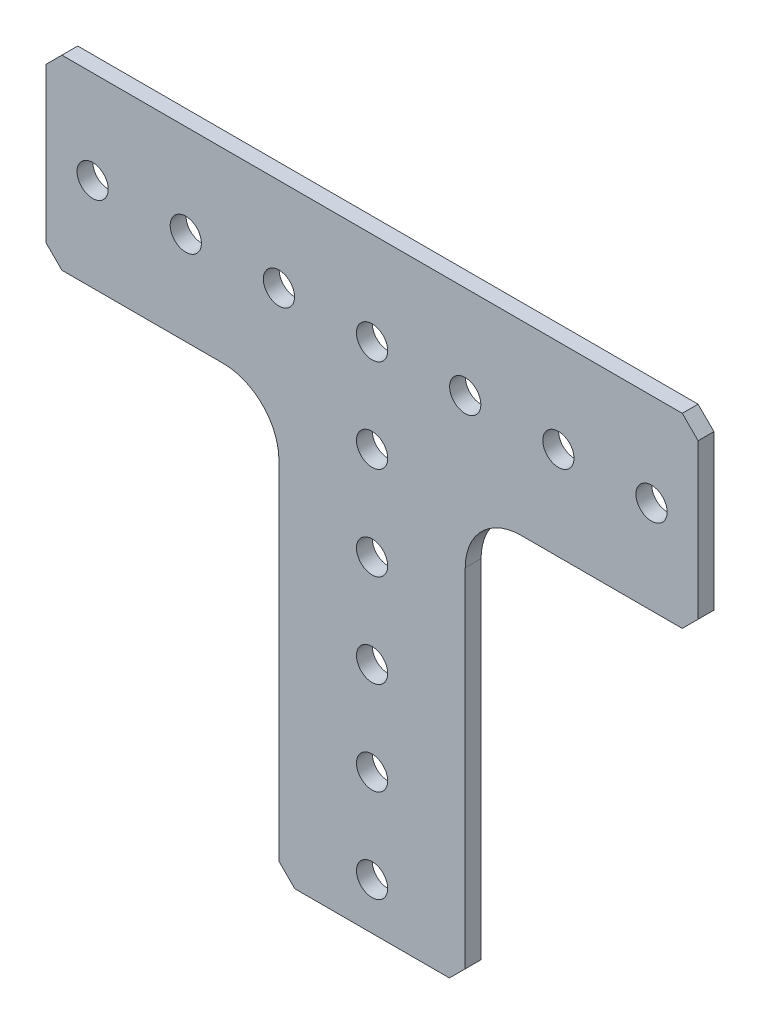
ISO-10303-21;
HEADER;
FILE_DESCRIPTION(('STEP AP214'),'2;1');
FILE_NAME('part.step','',(''),(''),'','','');
FILE_SCHEMA(('AUTOMOTIVE_DESIGN { 1 0 10303 214 1 1 1 1 }'));
ENDSEC;
DATA;
#1=APPLICATION_CONTEXT('core data for automotive mechanical design processes');
#2=APPLICATION_PROTOCOL_DEFINITION('international standard','automotive_design',2000,#1);
#3=PRODUCT_CONTEXT('',#1,'mechanical');
#4=PRODUCT('Part','Part','',(#3));
#5=PRODUCT_RELATED_PRODUCT_CATEGORY('part','',(#4));
#6=PRODUCT_DEFINITION_FORMATION('','',#4);
#7=PRODUCT_DEFINITION_CONTEXT('part definition',#1,'design');
#8=PRODUCT_DEFINITION('design','',#6,#7);
#9=PRODUCT_DEFINITION_SHAPE('','',#8);
#10=(LENGTH_UNIT() NAMED_UNIT(*) SI_UNIT(.MILLI.,.METRE.));
#11=(NAMED_UNIT(*) PLANE_ANGLE_UNIT() SI_UNIT($,.RADIAN.));
#12=(NAMED_UNIT(*) SI_UNIT($,.STERADIAN.) SOLID_ANGLE_UNIT());
#13=UNCERTAINTY_MEASURE_WITH_UNIT(LENGTH_MEASURE(1.E-05),#10,'distance_accuracy_value','');
#14=(GEOMETRIC_REPRESENTATION_CONTEXT(3) GLOBAL_UNCERTAINTY_ASSIGNED_CONTEXT((#13)) GLOBAL_UNIT_ASSIGNED_CONTEXT((#10,
#11,#12)) REPRESENTATION_CONTEXT('',''));
#15=CARTESIAN_POINT('',(0.,0.,0.));
#16=DIRECTION('',(0.,0.,1.));
#17=DIRECTION('',(1.,0.,0.));
#18=AXIS2_PLACEMENT_3D('',#15,#16,#17);
#19=CARTESIAN_POINT('',(0.,40.5708001075466,2.159));
#20=DIRECTION('',(0.,-1.,0.));
#21=DIRECTION('',(0.,0.,-1.));
#22=AXIS2_PLACEMENT_3D('',#19,#20,#21);
#23=PLANE('',#22);
#24=DIRECTION('',(-1.,0.,0.));
#25=VECTOR('',#24,1.);
#26=CARTESIAN_POINT('',(0.,40.5708001075466,0.));
#27=LINE('',#26,#25);
#28=CARTESIAN_POINT('',(25.0759547845133,40.5708001075466,0.));
#29=VERTEX_POINT('',#28);
#30=CARTESIAN_POINT('',(3.10495478451329,40.5708001075466,0.));
#31=VERTEX_POINT('',#30);
#32=EDGE_CURVE('E156',#29,#31,#27,.T.);
#33=ORIENTED_EDGE('',*,*,#32,.F.);
#34=DIRECTION('',(0.,0.,1.));
#35=VECTOR('',#34,1.);
#36=CARTESIAN_POINT('',(25.0759547845133,40.5708001075466,2.159));
#37=LINE('',#36,#35);
#38=CARTESIAN_POINT('',(25.0759547845133,40.5708001075466,2.159));
#39=VERTEX_POINT('',#38);
#40=EDGE_CURVE('E11',#29,#39,#37,.T.);
#41=ORIENTED_EDGE('',*,*,#40,.T.);
#42=DIRECTION('',(-1.,0.,0.));
#43=VECTOR('',#42,1.);
#44=CARTESIAN_POINT('',(0.,40.5708001075466,2.159));
#45=LINE('',#44,#43);
#46=CARTESIAN_POINT('',(3.10495478451329,40.5708001075466,2.159));
#47=VERTEX_POINT('',#46);
#48=EDGE_CURVE('E185',#39,#47,#45,.T.);
#49=ORIENTED_EDGE('',*,*,#48,.T.);
#50=DIRECTION('',(0.,0.,-1.));
#51=VECTOR('',#50,1.);
#52=CARTESIAN_POINT('',(3.10495478451329,40.5708001075466,0.));
#53=LINE('',#52,#51);
#54=EDGE_CURVE('E178',#47,#31,#53,.T.);
#55=ORIENTED_EDGE('',*,*,#54,.T.);
#56=EDGE_LOOP('',(#33,#41,#49,#55));
#57=FACE_BOUND('',#56,.T.);
#58=ADVANCED_FACE('F41',(#57),#23,.T.);
#59=CARTESIAN_POINT('',(27.2349547845133,0.,2.159));
#60=DIRECTION('',(1.,0.,0.));
#61=DIRECTION('',(0.,0.,-1.));
#62=AXIS2_PLACEMENT_3D('',#59,#60,#61);
#63=PLANE('',#62);
#64=DIRECTION('',(0.,-1.,0.));
#65=VECTOR('',#64,1.);
#66=CARTESIAN_POINT('',(27.2349547845133,0.,0.));
#67=LINE('',#66,#65);
#68=CARTESIAN_POINT('',(27.2349547845133,63.8118001075466,0.));
#69=VERTEX_POINT('',#68);
#70=CARTESIAN_POINT('',(27.2349547845133,42.7298001075466,0.));
#71=VERTEX_POINT('',#70);
#72=EDGE_CURVE('E169',#69,#71,#67,.T.);
#73=ORIENTED_EDGE('',*,*,#72,.F.);
#74=DIRECTION('',(0.,0.,1.));
#75=VECTOR('',#74,1.);
#76=CARTESIAN_POINT('',(27.2349547845133,63.8118001075466,2.159));
#77=LINE('',#76,#75);
#78=CARTESIAN_POINT('',(27.2349547845133,63.8118001075466,2.159));
#79=VERTEX_POINT('',#78);
#80=EDGE_CURVE('E50',#69,#79,#77,.T.);
#81=ORIENTED_EDGE('',*,*,#80,.T.);
#82=DIRECTION('',(0.,-1.,0.));
#83=VECTOR('',#82,1.);
#84=CARTESIAN_POINT('',(27.2349547845133,0.,2.159));
#85=LINE('',#84,#83);
#86=CARTESIAN_POINT('',(27.2349547845133,42.7298001075466,2.159));
#87=VERTEX_POINT('',#86);
#88=EDGE_CURVE('E288',#79,#87,#85,.T.);
#89=ORIENTED_EDGE('',*,*,#88,.T.);
#90=DIRECTION('',(0.,0.,-1.));
#91=VECTOR('',#90,1.);
#92=CARTESIAN_POINT('',(27.2349547845133,42.7298001075466,2.159));
#93=LINE('',#92,#91);
#94=EDGE_CURVE('E278',#87,#71,#93,.T.);
#95=ORIENTED_EDGE('',*,*,#94,.T.);
#96=EDGE_LOOP('',(#73,#81,#89,#95));
#97=FACE_BOUND('',#96,.T.);
#98=ADVANCED_FACE('F287',(#97),#63,.T.);
#99=CARTESIAN_POINT('',(0.,65.9708001075466,2.159));
#100=DIRECTION('',(0.,1.,0.));
#101=DIRECTION('',(0.,0.,1.));
#102=AXIS2_PLACEMENT_3D('',#99,#100,#101);
#103=PLANE('',#102);
#104=DIRECTION('',(1.,0.,0.));
#105=VECTOR('',#104,1.);
#106=CARTESIAN_POINT('',(0.,65.9708001075466,0.));
#107=LINE('',#106,#105);
#108=CARTESIAN_POINT('',(-59.5060452154867,65.9708001075466,0.));
#109=VERTEX_POINT('',#108);
#110=CARTESIAN_POINT('',(25.0759547845133,65.9708001075466,0.));
#111=VERTEX_POINT('',#110);
#112=EDGE_CURVE('E305',#109,#111,#107,.T.);
#113=ORIENTED_EDGE('',*,*,#112,.F.);
#114=DIRECTION('',(0.,0.,1.));
#115=VECTOR('',#114,1.);
#116=CARTESIAN_POINT('',(-59.5060452154867,65.9708001075466,2.159));
#117=LINE('',#116,#115);
#118=CARTESIAN_POINT('',(-59.5060452154867,65.9708001075466,2.159));
#119=VERTEX_POINT('',#118);
#120=EDGE_CURVE('E241',#109,#119,#117,.T.);
#121=ORIENTED_EDGE('',*,*,#120,.T.);
#122=DIRECTION('',(1.,0.,0.));
#123=VECTOR('',#122,1.);
#124=CARTESIAN_POINT('',(0.,65.9708001075466,2.159));
#125=LINE('',#124,#123);
#126=CARTESIAN_POINT('',(25.0759547845133,65.9708001075466,2.159));
#127=VERTEX_POINT('',#126);
#128=EDGE_CURVE('E297',#119,#127,#125,.T.);
#129=ORIENTED_EDGE('',*,*,#128,.T.);
#130=DIRECTION('',(0.,0.,-1.));
#131=VECTOR('',#130,1.);
#132=CARTESIAN_POINT('',(25.0759547845133,65.9708001075466,2.159));
#133=LINE('',#132,#131);
#134=EDGE_CURVE('E237',#127,#111,#133,.T.);
#135=ORIENTED_EDGE('',*,*,#134,.T.);
#136=EDGE_LOOP('',(#113,#121,#129,#135));
#137=FACE_BOUND('',#136,.T.);
#138=ADVANCED_FACE('F304',(#137),#103,.T.);
#139=CARTESIAN_POINT('',(-61.6650452154867,0.,2.159));
#140=DIRECTION('',(-1.,0.,0.));
#141=DIRECTION('',(0.,0.,1.));
#142=AXIS2_PLACEMENT_3D('',#139,#140,#141);
#143=PLANE('',#142);
#144=DIRECTION('',(0.,1.,0.));
#145=VECTOR('',#144,1.);
#146=CARTESIAN_POINT('',(-61.6650452154867,0.,2.159));
#147=LINE('',#146,#145);
#148=CARTESIAN_POINT('',(-61.6650452154867,42.7298001075466,2.159));
#149=VERTEX_POINT('',#148);
#150=CARTESIAN_POINT('',(-61.6650452154867,63.8118001075466,2.159));
#151=VERTEX_POINT('',#150);
#152=EDGE_CURVE('E329',#149,#151,#147,.T.);
#153=ORIENTED_EDGE('',*,*,#152,.T.);
#154=DIRECTION('',(0.,0.,-1.));
#155=VECTOR('',#154,1.);
#156=CARTESIAN_POINT('',(-61.6650452154867,63.8118001075466,2.159));
#157=LINE('',#156,#155);
#158=CARTESIAN_POINT('',(-61.6650452154867,63.8118001075466,0.));
#159=VERTEX_POINT('',#158);
#160=EDGE_CURVE('E216',#151,#159,#157,.T.);
#161=ORIENTED_EDGE('',*,*,#160,.T.);
#162=DIRECTION('',(0.,1.,0.));
#163=VECTOR('',#162,1.);
#164=CARTESIAN_POINT('',(-61.6650452154867,0.,0.));
#165=LINE('',#164,#163);
#166=CARTESIAN_POINT('',(-61.6650452154867,42.7298001075466,0.));
#167=VERTEX_POINT('',#166);
#168=EDGE_CURVE('E308',#167,#159,#165,.T.);
#169=ORIENTED_EDGE('',*,*,#168,.F.);
#170=DIRECTION('',(0.,0.,1.));
#171=VECTOR('',#170,1.);
#172=CARTESIAN_POINT('',(-61.6650452154867,42.7298001075466,2.159));
#173=LINE('',#172,#171);
#174=EDGE_CURVE('E213',#167,#149,#173,.T.);
#175=ORIENTED_EDGE('',*,*,#174,.T.);
#176=EDGE_LOOP('',(#153,#161,#169,#175));
#177=FACE_BOUND('',#176,.T.);
#178=ADVANCED_FACE('F374',(#177),#143,.T.);
#179=CARTESIAN_POINT('',(-37.5350452154867,40.5708001075466,2.159));
#180=VERTEX_POINT('',#179);
#181=CARTESIAN_POINT('',(-59.5060452154867,40.5708001075466,2.159));
#182=VERTEX_POINT('',#181);
#183=EDGE_CURVE('E324',#180,#182,#45,.T.);
#184=ORIENTED_EDGE('',*,*,#183,.T.);
#185=DIRECTION('',(0.,0.,-1.));
#186=VECTOR('',#185,1.);
#187=CARTESIAN_POINT('',(-59.5060452154867,40.5708001075466,2.159));
#188=LINE('',#187,#186);
#189=CARTESIAN_POINT('',(-59.5060452154867,40.5708001075466,0.));
#190=VERTEX_POINT('',#189);
#191=EDGE_CURVE('E261',#182,#190,#188,.T.);
#192=ORIENTED_EDGE('',*,*,#191,.T.);
#193=CARTESIAN_POINT('',(-37.5350452154867,40.5708001075466,0.));
#194=VERTEX_POINT('',#193);
#195=EDGE_CURVE('E172',#194,#190,#27,.T.);
#196=ORIENTED_EDGE('',*,*,#195,.F.);
#197=DIRECTION('',(0.,0.,-1.));
#198=VECTOR('',#197,1.);
#199=CARTESIAN_POINT('',(-37.5350452154867,40.5708001075466,2.159));
#200=LINE('',#199,#198);
#201=EDGE_CURVE('E182',#194,#180,#200,.F.);
#202=ORIENTED_EDGE('',*,*,#201,.T.);
#203=EDGE_LOOP('',(#184,#192,#196,#202));
#204=FACE_BOUND('',#203,.T.);
#205=ADVANCED_FACE('F365',(#204),#23,.T.);
#206=CARTESIAN_POINT('',(-29.9150452154867,0.,2.159));
#207=DIRECTION('',(1.,0.,0.));
#208=DIRECTION('',(0.,1.,0.));
#209=AXIS2_PLACEMENT_3D('',#206,#207,#208);
#210=PLANE('',#209);
#211=DIRECTION('',(0.,-1.,0.));
#212=VECTOR('',#211,1.);
#213=CARTESIAN_POINT('',(-29.9150452154867,0.,0.));
#214=LINE('',#213,#212);
#215=CARTESIAN_POINT('',(-29.9150452154867,32.9508001075466,0.));
#216=VERTEX_POINT('',#215);
#217=CARTESIAN_POINT('',(-29.9150452154867,-14.4201998924534,0.));
#218=VERTEX_POINT('',#217);
#219=EDGE_CURVE('E315',#216,#218,#214,.T.);
#220=ORIENTED_EDGE('',*,*,#219,.T.);
#221=DIRECTION('',(0.,0.,1.));
#222=VECTOR('',#221,1.);
#223=CARTESIAN_POINT('',(-29.9150452154867,-14.4201998924534,2.159));
#224=LINE('',#223,#222);
#225=CARTESIAN_POINT('',(-29.9150452154867,-14.4201998924534,2.159));
#226=VERTEX_POINT('',#225);
#227=EDGE_CURVE('E271',#218,#226,#224,.T.);
#228=ORIENTED_EDGE('',*,*,#227,.T.);
#229=DIRECTION('',(0.,-1.,0.));
#230=VECTOR('',#229,1.);
#231=CARTESIAN_POINT('',(-29.9150452154867,0.,2.159));
#232=LINE('',#231,#230);
#233=CARTESIAN_POINT('',(-29.9150452154867,32.9508001075466,2.159));
#234=VERTEX_POINT('',#233);
#235=EDGE_CURVE('E328',#234,#226,#232,.T.);
#236=ORIENTED_EDGE('',*,*,#235,.F.);
#237=DIRECTION('',(0.,0.,-1.));
#238=VECTOR('',#237,1.);
#239=CARTESIAN_POINT('',(-29.9150452154867,32.9508001075466,2.159));
#240=LINE('',#239,#238);
#241=EDGE_CURVE('E192',#234,#216,#240,.T.);
#242=ORIENTED_EDGE('',*,*,#241,.T.);
#243=EDGE_LOOP('',(#220,#228,#236,#242));
#244=FACE_BOUND('',#243,.T.);
#245=ADVANCED_FACE('F373',(#244),#210,.F.);
#246=CARTESIAN_POINT('',(0.,-16.5791998924534,2.159));
#247=DIRECTION('',(0.,1.,0.));
#248=DIRECTION('',(0.,0.,1.));
#249=AXIS2_PLACEMENT_3D('',#246,#247,#248);
#250=PLANE('',#249);
#251=DIRECTION('',(1.,0.,0.));
#252=VECTOR('',#251,1.);
#253=CARTESIAN_POINT('',(0.,-16.5791998924534,2.159));
#254=LINE('',#253,#252);
#255=CARTESIAN_POINT('',(-27.7560452154867,-16.5791998924534,2.159));
#256=VERTEX_POINT('',#255);
#257=CARTESIAN_POINT('',(-6.6740452154867,-16.5791998924534,2.159));
#258=VERTEX_POINT('',#257);
#259=EDGE_CURVE('E194',#256,#258,#254,.T.);
#260=ORIENTED_EDGE('',*,*,#259,.F.);
#261=DIRECTION('',(0.,0.,-1.));
#262=VECTOR('',#261,1.);
#263=CARTESIAN_POINT('',(-27.7560452154867,-16.5791998924534,2.159));
#264=LINE('',#263,#262);
#265=CARTESIAN_POINT('',(-27.7560452154867,-16.5791998924534,0.));
#266=VERTEX_POINT('',#265);
#267=EDGE_CURVE('E267',#256,#266,#264,.T.);
#268=ORIENTED_EDGE('',*,*,#267,.T.);
#269=DIRECTION('',(1.,0.,0.));
#270=VECTOR('',#269,1.);
#271=CARTESIAN_POINT('',(0.,-16.5791998924534,0.));
#272=LINE('',#271,#270);
#273=CARTESIAN_POINT('',(-6.6740452154867,-16.5791998924534,0.));
#274=VERTEX_POINT('',#273);
#275=EDGE_CURVE('E318',#266,#274,#272,.T.);
#276=ORIENTED_EDGE('',*,*,#275,.T.);
#277=DIRECTION('',(0.,0.,1.));
#278=VECTOR('',#277,1.);
#279=CARTESIAN_POINT('',(-6.6740452154867,-16.5791998924534,2.159));
#280=LINE('',#279,#278);
#281=EDGE_CURVE('E65',#274,#258,#280,.T.);
#282=ORIENTED_EDGE('',*,*,#281,.T.);
#283=EDGE_LOOP('',(#260,#268,#276,#282));
#284=FACE_BOUND('',#283,.T.);
#285=ADVANCED_FACE('F379',(#284),#250,.F.);
#286=CARTESIAN_POINT('',(-4.51504521548671,0.,2.159));
#287=DIRECTION('',(1.,0.,0.));
#288=DIRECTION('',(0.,1.,0.));
#289=AXIS2_PLACEMENT_3D('',#286,#287,#288);
#290=PLANE('',#289);
#291=DIRECTION('',(0.,-1.,0.));
#292=VECTOR('',#291,1.);
#293=CARTESIAN_POINT('',(-4.51504521548671,0.,2.159));
#294=LINE('',#293,#292);
#295=CARTESIAN_POINT('',(-4.51504521548671,32.9508001075466,2.159));
#296=VERTEX_POINT('',#295);
#297=CARTESIAN_POINT('',(-4.51504521548671,-14.4201998924534,2.159));
#298=VERTEX_POINT('',#297);
#299=EDGE_CURVE('E188',#296,#298,#294,.T.);
#300=ORIENTED_EDGE('',*,*,#299,.T.);
#301=DIRECTION('',(0.,0.,-1.));
#302=VECTOR('',#301,1.);
#303=CARTESIAN_POINT('',(-4.51504521548671,-14.4201998924534,0.));
#304=LINE('',#303,#302);
#305=CARTESIAN_POINT('',(-4.51504521548671,-14.4201998924534,0.));
#306=VERTEX_POINT('',#305);
#307=EDGE_CURVE('E274',#298,#306,#304,.T.);
#308=ORIENTED_EDGE('',*,*,#307,.T.);
#309=DIRECTION('',(0.,-1.,0.));
#310=VECTOR('',#309,1.);
#311=CARTESIAN_POINT('',(-4.51504521548671,0.,0.));
#312=LINE('',#311,#310);
#313=CARTESIAN_POINT('',(-4.51504521548671,32.9508001075466,0.));
#314=VERTEX_POINT('',#313);
#315=EDGE_CURVE('E197',#314,#306,#312,.T.);
#316=ORIENTED_EDGE('',*,*,#315,.F.);
#317=DIRECTION('',(0.,0.,-1.));
#318=VECTOR('',#317,1.);
#319=CARTESIAN_POINT('',(-4.51504521548671,32.9508001075466,2.159));
#320=LINE('',#319,#318);
#321=EDGE_CURVE('E179',#314,#296,#320,.F.);
#322=ORIENTED_EDGE('',*,*,#321,.T.);
#323=EDGE_LOOP('',(#300,#308,#316,#322));
#324=FACE_BOUND('',#323,.T.);
#325=ADVANCED_FACE('F352',(#324),#290,.T.);
#326=CARTESIAN_POINT('',(0.,0.,2.159));
#327=DIRECTION('',(0.,0.,1.));
#328=DIRECTION('',(1.,0.,0.));
#329=AXIS2_PLACEMENT_3D('',#326,#327,#328);
#330=PLANE('',#329);
#331=CARTESIAN_POINT('',(-55.3150452154869,53.2708001075464,2.159));
#332=DIRECTION('',(0.,0.,1.));
#333=DIRECTION('',(1.,0.,0.));
#334=AXIS2_PLACEMENT_3D('',#331,#332,#333);
#335=CIRCLE('',#334,2.12725);
#336=CARTESIAN_POINT('',(-53.1877952154869,53.2708001075464,2.159));
#337=VERTEX_POINT('',#336);
#338=EDGE_CURVE('E652',#337,#337,#335,.T.);
#339=ORIENTED_EDGE('',*,*,#338,.F.);
#340=EDGE_LOOP('',(#339));
#341=FACE_BOUND('',#340,.T.);
#342=CARTESIAN_POINT('',(-42.6150452154869,53.2708001075464,2.159));
#343=DIRECTION('',(0.,0.,1.));
#344=DIRECTION('',(1.,0.,0.));
#345=AXIS2_PLACEMENT_3D('',#342,#343,#344);
#346=CIRCLE('',#345,2.12725);
#347=CARTESIAN_POINT('',(-40.4877952154869,53.2708001075464,2.159));
#348=VERTEX_POINT('',#347);
#349=EDGE_CURVE('E656',#348,#348,#346,.T.);
#350=ORIENTED_EDGE('',*,*,#349,.F.);
#351=EDGE_LOOP('',(#350));
#352=FACE_BOUND('',#351,.T.);
#353=CARTESIAN_POINT('',(-29.9150452154869,53.2708001075465,2.159));
#354=DIRECTION('',(0.,0.,1.));
#355=DIRECTION('',(1.,0.,0.));
#356=AXIS2_PLACEMENT_3D('',#353,#354,#355);
#357=CIRCLE('',#356,2.12725);
#358=CARTESIAN_POINT('',(-27.7877952154869,53.2708001075465,2.159));
#359=VERTEX_POINT('',#358);
#360=EDGE_CURVE('E666',#359,#359,#357,.T.);
#361=ORIENTED_EDGE('',*,*,#360,.F.);
#362=EDGE_LOOP('',(#361));
#363=FACE_BOUND('',#362,.T.);
#364=CARTESIAN_POINT('',(-17.2150452154869,53.2708001075465,2.159));
#365=DIRECTION('',(0.,0.,1.));
#366=DIRECTION('',(1.,0.,0.));
#367=AXIS2_PLACEMENT_3D('',#364,#365,#366);
#368=CIRCLE('',#367,2.12725);
#369=CARTESIAN_POINT('',(-15.0877952154869,53.2708001075465,2.159));
#370=VERTEX_POINT('',#369);
#371=EDGE_CURVE('E674',#370,#370,#368,.T.);
#372=ORIENTED_EDGE('',*,*,#371,.F.);
#373=EDGE_LOOP('',(#372));
#374=FACE_BOUND('',#373,.T.);
#375=CARTESIAN_POINT('',(-4.51504521548688,53.2708001075466,2.159));
#376=DIRECTION('',(0.,0.,1.));
#377=DIRECTION('',(1.,0.,0.));
#378=AXIS2_PLACEMENT_3D('',#375,#376,#377);
#379=CIRCLE('',#378,2.12725);
#380=CARTESIAN_POINT('',(-2.38779521548688,53.2708001075466,2.159));
#381=VERTEX_POINT('',#380);
#382=EDGE_CURVE('E682',#381,#381,#379,.T.);
#383=ORIENTED_EDGE('',*,*,#382,.F.);
#384=EDGE_LOOP('',(#383));
#385=FACE_BOUND('',#384,.T.);
#386=CARTESIAN_POINT('',(8.18495478451312,53.2708001075466,2.159));
#387=DIRECTION('',(0.,0.,1.));
#388=DIRECTION('',(1.,0.,0.));
#389=AXIS2_PLACEMENT_3D('',#386,#387,#388);
#390=CIRCLE('',#389,2.12725);
#391=CARTESIAN_POINT('',(10.3122047845131,53.2708001075466,2.159));
#392=VERTEX_POINT('',#391);
#393=EDGE_CURVE('E690',#392,#392,#390,.T.);
#394=ORIENTED_EDGE('',*,*,#393,.F.);
#395=EDGE_LOOP('',(#394));
#396=FACE_BOUND('',#395,.T.);
#397=CARTESIAN_POINT('',(20.8849547845131,53.2708001075466,2.159));
#398=DIRECTION('',(0.,0.,1.));
#399=DIRECTION('',(1.,0.,0.));
#400=AXIS2_PLACEMENT_3D('',#397,#398,#399);
#401=CIRCLE('',#400,2.12725);
#402=CARTESIAN_POINT('',(23.0122047845131,53.2708001075466,2.159));
#403=VERTEX_POINT('',#402);
#404=EDGE_CURVE('E698',#403,#403,#401,.T.);
#405=ORIENTED_EDGE('',*,*,#404,.F.);
#406=EDGE_LOOP('',(#405));
#407=FACE_BOUND('',#406,.T.);
#408=CARTESIAN_POINT('',(-17.2150452154868,40.5708001075466,2.159));
#409=DIRECTION('',(0.,0.,1.));
#410=DIRECTION('',(1.,0.,0.));
#411=AXIS2_PLACEMENT_3D('',#408,#409,#410);
#412=CIRCLE('',#411,2.12725);
#413=CARTESIAN_POINT('',(-15.0877952154868,40.5708001075466,2.159));
#414=VERTEX_POINT('',#413);
#415=EDGE_CURVE('E706',#414,#414,#412,.T.);
#416=ORIENTED_EDGE('',*,*,#415,.F.);
#417=EDGE_LOOP('',(#416));
#418=FACE_BOUND('',#417,.T.);
#419=CARTESIAN_POINT('',(-17.2150452154868,27.8708001075466,2.159));
#420=DIRECTION('',(0.,0.,1.));
#421=DIRECTION('',(1.,0.,0.));
#422=AXIS2_PLACEMENT_3D('',#419,#420,#421);
#423=CIRCLE('',#422,2.12725);
#424=CARTESIAN_POINT('',(-15.0877952154868,27.8708001075466,2.159));
#425=VERTEX_POINT('',#424);
#426=EDGE_CURVE('E714',#425,#425,#423,.T.);
#427=ORIENTED_EDGE('',*,*,#426,.F.);
#428=EDGE_LOOP('',(#427));
#429=FACE_BOUND('',#428,.T.);
#430=CARTESIAN_POINT('',(-17.2150452154867,15.1708001075466,2.159));
#431=DIRECTION('',(0.,0.,1.));
#432=DIRECTION('',(1.,0.,0.));
#433=AXIS2_PLACEMENT_3D('',#430,#431,#432);
#434=CIRCLE('',#433,2.12725);
#435=CARTESIAN_POINT('',(-15.0877952154867,15.1708001075466,2.159));
#436=VERTEX_POINT('',#435);
#437=EDGE_CURVE('E722',#436,#436,#434,.T.);
#438=ORIENTED_EDGE('',*,*,#437,.F.);
#439=EDGE_LOOP('',(#438));
#440=FACE_BOUND('',#439,.T.);
#441=CARTESIAN_POINT('',(-17.2150452154867,2.47080010754662,2.159));
#442=DIRECTION('',(0.,0.,1.));
#443=DIRECTION('',(1.,0.,0.));
#444=AXIS2_PLACEMENT_3D('',#441,#442,#443);
#445=CIRCLE('',#444,2.12725);
#446=CARTESIAN_POINT('',(-15.0877952154867,2.47080010754662,2.159));
#447=VERTEX_POINT('',#446);
#448=EDGE_CURVE('E730',#447,#447,#445,.T.);
#449=ORIENTED_EDGE('',*,*,#448,.F.);
#450=EDGE_LOOP('',(#449));
#451=FACE_BOUND('',#450,.T.);
#452=CARTESIAN_POINT('',(-17.2150452154867,-10.2291998924534,2.159));
#453=DIRECTION('',(0.,0.,1.));
#454=DIRECTION('',(1.,0.,0.));
#455=AXIS2_PLACEMENT_3D('',#452,#453,#454);
#456=CIRCLE('',#455,2.12725);
#457=CARTESIAN_POINT('',(-15.0877952154867,-10.2291998924534,2.159));
#458=VERTEX_POINT('',#457);
#459=EDGE_CURVE('E738',#458,#458,#456,.T.);
#460=ORIENTED_EDGE('',*,*,#459,.F.);
#461=EDGE_LOOP('',(#460));
#462=FACE_BOUND('',#461,.T.);
#463=ORIENTED_EDGE('',*,*,#128,.F.);
#464=DIRECTION('',(0.70710678118655,0.707106781186545,0.));
#465=VECTOR('',#464,1.);
#466=CARTESIAN_POINT('',(-62.7384226615165,62.7384226615169,2.159));
#467=LINE('',#466,#465);
#468=EDGE_CURVE('E258',#119,#151,#467,.F.);
#469=ORIENTED_EDGE('',*,*,#468,.T.);
#470=ORIENTED_EDGE('',*,*,#152,.F.);
#471=DIRECTION('',(-0.707106781186548,0.707106781186548,0.));
#472=VECTOR('',#471,1.);
#473=CARTESIAN_POINT('',(-9.46762255397004,-9.46762255397004,2.159));
#474=LINE('',#473,#472);
#475=EDGE_CURVE('E255',#149,#182,#474,.F.);
#476=ORIENTED_EDGE('',*,*,#475,.T.);
#477=ORIENTED_EDGE('',*,*,#183,.F.);
#478=CARTESIAN_POINT('',(-37.5350452154867,32.9508001075466,2.159));
#479=DIRECTION('',(0.,0.,1.));
#480=DIRECTION('',(1.,0.,0.));
#481=AXIS2_PLACEMENT_3D('',#478,#479,#480);
#482=CIRCLE('',#481,7.62);
#483=EDGE_CURVE('E210',#180,#234,#482,.F.);
#484=ORIENTED_EDGE('',*,*,#483,.T.);
#485=ORIENTED_EDGE('',*,*,#235,.T.);
#486=DIRECTION('',(-0.707106781186548,0.707106781186548,0.));
#487=VECTOR('',#486,1.);
#488=CARTESIAN_POINT('',(-22.16762255397,-22.16762255397,2.159));
#489=LINE('',#488,#487);
#490=EDGE_CURVE('E252',#226,#256,#489,.F.);
#491=ORIENTED_EDGE('',*,*,#490,.T.);
#492=ORIENTED_EDGE('',*,*,#259,.T.);
#493=DIRECTION('',(0.707106781186548,0.707106781186548,0.));
#494=VECTOR('',#493,1.);
#495=CARTESIAN_POINT('',(4.95257733848334,-4.95257733848334,2.159));
#496=LINE('',#495,#494);
#497=EDGE_CURVE('E57',#258,#298,#496,.T.);
#498=ORIENTED_EDGE('',*,*,#497,.T.);
#499=ORIENTED_EDGE('',*,*,#299,.F.);
#500=CARTESIAN_POINT('',(3.10495478451329,32.9508001075466,2.159));
#501=DIRECTION('',(0.,0.,1.));
#502=DIRECTION('',(1.,0.,0.));
#503=AXIS2_PLACEMENT_3D('',#500,#501,#502);
#504=CIRCLE('',#503,7.62);
#505=EDGE_CURVE('E181',#296,#47,#504,.F.);
#506=ORIENTED_EDGE('',*,*,#505,.T.);
#507=ORIENTED_EDGE('',*,*,#48,.F.);
#508=DIRECTION('',(-0.707106781186548,-0.707106781186548,0.));
#509=VECTOR('',#508,1.);
#510=CARTESIAN_POINT('',(-7.74742266151667,7.74742266151667,2.159));
#511=LINE('',#510,#509);
#512=EDGE_CURVE('E244',#39,#87,#511,.F.);
#513=ORIENTED_EDGE('',*,*,#512,.T.);
#514=ORIENTED_EDGE('',*,*,#88,.F.);
#515=DIRECTION('',(0.70710678118655,-0.707106781186545,0.));
#516=VECTOR('',#515,1.);
#517=CARTESIAN_POINT('',(45.5233774460299,45.5233774460302,2.159));
#518=LINE('',#517,#516);
#519=EDGE_CURVE('E247',#79,#127,#518,.F.);
#520=ORIENTED_EDGE('',*,*,#519,.T.);
#521=EDGE_LOOP('',(#463,#469,#470,#476,#477,#484,#485,#491,#492,#498,#499,#506,#507,#513,#514,#520));
#522=FACE_BOUND('',#521,.T.);
#523=ADVANCED_FACE('F293',(#341,#352,#363,#374,#385,#396,#407,#418,#429,#440,#451,#462,#522),
#330,.T.);
#524=CARTESIAN_POINT('',(0.,0.,0.));
#525=DIRECTION('',(0.,0.,1.));
#526=DIRECTION('',(1.,0.,0.));
#527=AXIS2_PLACEMENT_3D('',#524,#525,#526);
#528=PLANE('',#527);
#529=CARTESIAN_POINT('',(-55.3150452154869,53.2708001075464,0.));
#530=DIRECTION('',(0.,0.,1.));
#531=DIRECTION('',(1.,0.,0.));
#532=AXIS2_PLACEMENT_3D('',#529,#530,#531);
#533=CIRCLE('',#532,2.12725);
#534=CARTESIAN_POINT('',(-53.1877952154869,53.2708001075464,0.));
#535=VERTEX_POINT('',#534);
#536=EDGE_CURVE('E649',#535,#535,#533,.T.);
#537=ORIENTED_EDGE('',*,*,#536,.T.);
#538=EDGE_LOOP('',(#537));
#539=FACE_BOUND('',#538,.T.);
#540=CARTESIAN_POINT('',(-42.6150452154869,53.2708001075464,0.));
#541=DIRECTION('',(0.,0.,1.));
#542=DIRECTION('',(1.,0.,0.));
#543=AXIS2_PLACEMENT_3D('',#540,#541,#542);
#544=CIRCLE('',#543,2.12725);
#545=CARTESIAN_POINT('',(-40.4877952154869,53.2708001075464,0.));
#546=VERTEX_POINT('',#545);
#547=EDGE_CURVE('E662',#546,#546,#544,.T.);
#548=ORIENTED_EDGE('',*,*,#547,.T.);
#549=EDGE_LOOP('',(#548));
#550=FACE_BOUND('',#549,.T.);
#551=CARTESIAN_POINT('',(-29.9150452154869,53.2708001075465,0.));
#552=DIRECTION('',(0.,0.,1.));
#553=DIRECTION('',(1.,0.,0.));
#554=AXIS2_PLACEMENT_3D('',#551,#552,#553);
#555=CIRCLE('',#554,2.12725);
#556=CARTESIAN_POINT('',(-27.7877952154869,53.2708001075465,0.));
#557=VERTEX_POINT('',#556);
#558=EDGE_CURVE('E670',#557,#557,#555,.T.);
#559=ORIENTED_EDGE('',*,*,#558,.T.);
#560=EDGE_LOOP('',(#559));
#561=FACE_BOUND('',#560,.T.);
#562=CARTESIAN_POINT('',(-17.2150452154869,53.2708001075465,0.));
#563=DIRECTION('',(0.,0.,1.));
#564=DIRECTION('',(1.,0.,0.));
#565=AXIS2_PLACEMENT_3D('',#562,#563,#564);
#566=CIRCLE('',#565,2.12725);
#567=CARTESIAN_POINT('',(-15.0877952154869,53.2708001075465,0.));
#568=VERTEX_POINT('',#567);
#569=EDGE_CURVE('E678',#568,#568,#566,.T.);
#570=ORIENTED_EDGE('',*,*,#569,.T.);
#571=EDGE_LOOP('',(#570));
#572=FACE_BOUND('',#571,.T.);
#573=CARTESIAN_POINT('',(-4.51504521548688,53.2708001075466,0.));
#574=DIRECTION('',(0.,0.,1.));
#575=DIRECTION('',(1.,0.,0.));
#576=AXIS2_PLACEMENT_3D('',#573,#574,#575);
#577=CIRCLE('',#576,2.12725);
#578=CARTESIAN_POINT('',(-2.38779521548688,53.2708001075466,0.));
#579=VERTEX_POINT('',#578);
#580=EDGE_CURVE('E686',#579,#579,#577,.T.);
#581=ORIENTED_EDGE('',*,*,#580,.T.);
#582=EDGE_LOOP('',(#581));
#583=FACE_BOUND('',#582,.T.);
#584=CARTESIAN_POINT('',(8.18495478451312,53.2708001075466,0.));
#585=DIRECTION('',(0.,0.,1.));
#586=DIRECTION('',(1.,0.,0.));
#587=AXIS2_PLACEMENT_3D('',#584,#585,#586);
#588=CIRCLE('',#587,2.12725);
#589=CARTESIAN_POINT('',(10.3122047845131,53.2708001075466,0.));
#590=VERTEX_POINT('',#589);
#591=EDGE_CURVE('E694',#590,#590,#588,.T.);
#592=ORIENTED_EDGE('',*,*,#591,.T.);
#593=EDGE_LOOP('',(#592));
#594=FACE_BOUND('',#593,.T.);
#595=CARTESIAN_POINT('',(20.8849547845131,53.2708001075466,0.));
#596=DIRECTION('',(0.,0.,1.));
#597=DIRECTION('',(1.,0.,0.));
#598=AXIS2_PLACEMENT_3D('',#595,#596,#597);
#599=CIRCLE('',#598,2.12725);
#600=CARTESIAN_POINT('',(23.0122047845131,53.2708001075466,0.));
#601=VERTEX_POINT('',#600);
#602=EDGE_CURVE('E702',#601,#601,#599,.T.);
#603=ORIENTED_EDGE('',*,*,#602,.T.);
#604=EDGE_LOOP('',(#603));
#605=FACE_BOUND('',#604,.T.);
#606=CARTESIAN_POINT('',(-17.2150452154868,40.5708001075466,0.));
#607=DIRECTION('',(0.,0.,1.));
#608=DIRECTION('',(1.,0.,0.));
#609=AXIS2_PLACEMENT_3D('',#606,#607,#608);
#610=CIRCLE('',#609,2.12725);
#611=CARTESIAN_POINT('',(-15.0877952154868,40.5708001075466,0.));
#612=VERTEX_POINT('',#611);
#613=EDGE_CURVE('E710',#612,#612,#610,.T.);
#614=ORIENTED_EDGE('',*,*,#613,.T.);
#615=EDGE_LOOP('',(#614));
#616=FACE_BOUND('',#615,.T.);
#617=CARTESIAN_POINT('',(-17.2150452154868,27.8708001075466,0.));
#618=DIRECTION('',(0.,0.,1.));
#619=DIRECTION('',(1.,0.,0.));
#620=AXIS2_PLACEMENT_3D('',#617,#618,#619);
#621=CIRCLE('',#620,2.12725);
#622=CARTESIAN_POINT('',(-15.0877952154868,27.8708001075466,0.));
#623=VERTEX_POINT('',#622);
#624=EDGE_CURVE('E718',#623,#623,#621,.T.);
#625=ORIENTED_EDGE('',*,*,#624,.T.);
#626=EDGE_LOOP('',(#625));
#627=FACE_BOUND('',#626,.T.);
#628=CARTESIAN_POINT('',(-17.2150452154867,15.1708001075466,0.));
#629=DIRECTION('',(0.,0.,1.));
#630=DIRECTION('',(1.,0.,0.));
#631=AXIS2_PLACEMENT_3D('',#628,#629,#630);
#632=CIRCLE('',#631,2.12725);
#633=CARTESIAN_POINT('',(-15.0877952154867,15.1708001075466,0.));
#634=VERTEX_POINT('',#633);
#635=EDGE_CURVE('E726',#634,#634,#632,.T.);
#636=ORIENTED_EDGE('',*,*,#635,.T.);
#637=EDGE_LOOP('',(#636));
#638=FACE_BOUND('',#637,.T.);
#639=CARTESIAN_POINT('',(-17.2150452154867,2.47080010754662,0.));
#640=DIRECTION('',(0.,0.,1.));
#641=DIRECTION('',(1.,0.,0.));
#642=AXIS2_PLACEMENT_3D('',#639,#640,#641);
#643=CIRCLE('',#642,2.12725);
#644=CARTESIAN_POINT('',(-15.0877952154867,2.47080010754662,0.));
#645=VERTEX_POINT('',#644);
#646=EDGE_CURVE('E734',#645,#645,#643,.T.);
#647=ORIENTED_EDGE('',*,*,#646,.T.);
#648=EDGE_LOOP('',(#647));
#649=FACE_BOUND('',#648,.T.);
#650=CARTESIAN_POINT('',(-17.2150452154867,-10.2291998924534,0.));
#651=DIRECTION('',(0.,0.,1.));
#652=DIRECTION('',(1.,0.,0.));
#653=AXIS2_PLACEMENT_3D('',#650,#651,#652);
#654=CIRCLE('',#653,2.12725);
#655=CARTESIAN_POINT('',(-15.0877952154867,-10.2291998924534,0.));
#656=VERTEX_POINT('',#655);
#657=EDGE_CURVE('E170',#656,#656,#654,.T.);
#658=ORIENTED_EDGE('',*,*,#657,.T.);
#659=EDGE_LOOP('',(#658));
#660=FACE_BOUND('',#659,.T.);
#661=ORIENTED_EDGE('',*,*,#168,.T.);
#662=DIRECTION('',(-0.70710678118655,-0.707106781186545,0.));
#663=VECTOR('',#662,1.);
#664=CARTESIAN_POINT('',(-61.6650452154867,63.8118001075466,0.));
#665=LINE('',#664,#663);
#666=EDGE_CURVE('E234',#159,#109,#665,.F.);
#667=ORIENTED_EDGE('',*,*,#666,.T.);
#668=ORIENTED_EDGE('',*,*,#112,.T.);
#669=DIRECTION('',(-0.70710678118655,0.707106781186545,0.));
#670=VECTOR('',#669,1.);
#671=CARTESIAN_POINT('',(25.0759547845133,65.9708001075466,0.));
#672=LINE('',#671,#670);
#673=EDGE_CURVE('E222',#111,#69,#672,.F.);
#674=ORIENTED_EDGE('',*,*,#673,.T.);
#675=ORIENTED_EDGE('',*,*,#72,.T.);
#676=DIRECTION('',(0.707106781186548,0.707106781186548,0.));
#677=VECTOR('',#676,1.);
#678=CARTESIAN_POINT('',(27.2349547845133,42.7298001075466,0.));
#679=LINE('',#678,#677);
#680=EDGE_CURVE('E164',#71,#29,#679,.F.);
#681=ORIENTED_EDGE('',*,*,#680,.T.);
#682=ORIENTED_EDGE('',*,*,#32,.T.);
#683=CARTESIAN_POINT('',(3.10495478451329,32.9508001075466,0.));
#684=DIRECTION('',(0.,0.,1.));
#685=DIRECTION('',(1.,0.,0.));
#686=AXIS2_PLACEMENT_3D('',#683,#684,#685);
#687=CIRCLE('',#686,7.62);
#688=EDGE_CURVE('E161',#31,#314,#687,.T.);
#689=ORIENTED_EDGE('',*,*,#688,.T.);
#690=ORIENTED_EDGE('',*,*,#315,.T.);
#691=DIRECTION('',(-0.707106781186548,-0.707106781186548,0.));
#692=VECTOR('',#691,1.);
#693=CARTESIAN_POINT('',(-4.51504521548671,-14.4201998924534,0.));
#694=LINE('',#693,#692);
#695=EDGE_CURVE('E225',#306,#274,#694,.T.);
#696=ORIENTED_EDGE('',*,*,#695,.T.);
#697=ORIENTED_EDGE('',*,*,#275,.F.);
#698=DIRECTION('',(0.707106781186548,-0.707106781186548,0.));
#699=VECTOR('',#698,1.);
#700=CARTESIAN_POINT('',(-27.7560452154867,-16.5791998924534,0.));
#701=LINE('',#700,#699);
#702=EDGE_CURVE('E228',#266,#218,#701,.F.);
#703=ORIENTED_EDGE('',*,*,#702,.T.);
#704=ORIENTED_EDGE('',*,*,#219,.F.);
#705=CARTESIAN_POINT('',(-37.5350452154867,32.9508001075466,0.));
#706=DIRECTION('',(0.,0.,1.));
#707=DIRECTION('',(1.,0.,0.));
#708=AXIS2_PLACEMENT_3D('',#705,#706,#707);
#709=CIRCLE('',#708,7.62);
#710=EDGE_CURVE('E207',#216,#194,#709,.T.);
#711=ORIENTED_EDGE('',*,*,#710,.T.);
#712=ORIENTED_EDGE('',*,*,#195,.T.);
#713=DIRECTION('',(0.707106781186548,-0.707106781186548,0.));
#714=VECTOR('',#713,1.);
#715=CARTESIAN_POINT('',(-59.5060452154867,40.5708001075466,0.));
#716=LINE('',#715,#714);
#717=EDGE_CURVE('E231',#190,#167,#716,.F.);
#718=ORIENTED_EDGE('',*,*,#717,.T.);
#719=EDGE_LOOP('',(#661,#667,#668,#674,#675,#681,#682,#689,#690,#696,#697,#703,#704,#711,#712,#718));
#720=FACE_BOUND('',#719,.T.);
#721=ADVANCED_FACE('F159',(#539,#550,#561,#572,#583,#594,#605,#616,#627,#638,#649,#660,#720),
#528,.F.);
#722=CARTESIAN_POINT('',(3.10495478451329,32.9508001075466,2.159));
#723=DIRECTION('',(0.,0.,1.));
#724=DIRECTION('',(1.,0.,0.));
#725=AXIS2_PLACEMENT_3D('',#722,#723,#724);
#726=CYLINDRICAL_SURFACE('',#725,7.62);
#727=ORIENTED_EDGE('',*,*,#505,.F.);
#728=ORIENTED_EDGE('',*,*,#321,.F.);
#729=ORIENTED_EDGE('',*,*,#688,.F.);
#730=ORIENTED_EDGE('',*,*,#54,.F.);
#731=EDGE_LOOP('',(#727,#728,#729,#730));
#732=FACE_BOUND('',#731,.T.);
#733=ADVANCED_FACE('F177',(#732),#726,.F.);
#734=CARTESIAN_POINT('',(-37.5350452154867,32.9508001075466,2.159));
#735=DIRECTION('',(0.,0.,-1.));
#736=DIRECTION('',(-1.,0.,0.));
#737=AXIS2_PLACEMENT_3D('',#734,#735,#736);
#738=CYLINDRICAL_SURFACE('',#737,7.62);
#739=ORIENTED_EDGE('',*,*,#483,.F.);
#740=ORIENTED_EDGE('',*,*,#201,.F.);
#741=ORIENTED_EDGE('',*,*,#710,.F.);
#742=ORIENTED_EDGE('',*,*,#241,.F.);
#743=EDGE_LOOP('',(#739,#740,#741,#742));
#744=FACE_BOUND('',#743,.T.);
#745=ADVANCED_FACE('F388',(#744),#738,.F.);
#746=CARTESIAN_POINT('',(-61.6650452154867,63.8118001075466,2.159));
#747=DIRECTION('',(0.707106781186545,-0.70710678118655,0.));
#748=DIRECTION('',(0.,0.,-1.));
#749=AXIS2_PLACEMENT_3D('',#746,#747,#748);
#750=PLANE('',#749);
#751=ORIENTED_EDGE('',*,*,#468,.F.);
#752=ORIENTED_EDGE('',*,*,#120,.F.);
#753=ORIENTED_EDGE('',*,*,#666,.F.);
#754=ORIENTED_EDGE('',*,*,#160,.F.);
#755=EDGE_LOOP('',(#751,#752,#753,#754));
#756=FACE_BOUND('',#755,.T.);
#757=ADVANCED_FACE('F391',(#756),#750,.F.);
#758=CARTESIAN_POINT('',(-59.5060452154867,40.5708001075466,2.159));
#759=DIRECTION('',(0.707106781186548,0.707106781186548,0.));
#760=DIRECTION('',(0.,0.,-1.));
#761=AXIS2_PLACEMENT_3D('',#758,#759,#760);
#762=PLANE('',#761);
#763=ORIENTED_EDGE('',*,*,#475,.F.);
#764=ORIENTED_EDGE('',*,*,#174,.F.);
#765=ORIENTED_EDGE('',*,*,#717,.F.);
#766=ORIENTED_EDGE('',*,*,#191,.F.);
#767=EDGE_LOOP('',(#763,#764,#765,#766));
#768=FACE_BOUND('',#767,.T.);
#769=ADVANCED_FACE('F395',(#768),#762,.F.);
#770=CARTESIAN_POINT('',(-27.7560452154867,-16.5791998924534,2.159));
#771=DIRECTION('',(0.707106781186548,0.707106781186548,0.));
#772=DIRECTION('',(0.,0.,-1.));
#773=AXIS2_PLACEMENT_3D('',#770,#771,#772);
#774=PLANE('',#773);
#775=ORIENTED_EDGE('',*,*,#490,.F.);
#776=ORIENTED_EDGE('',*,*,#227,.F.);
#777=ORIENTED_EDGE('',*,*,#702,.F.);
#778=ORIENTED_EDGE('',*,*,#267,.F.);
#779=EDGE_LOOP('',(#775,#776,#777,#778));
#780=FACE_BOUND('',#779,.T.);
#781=ADVANCED_FACE('F399',(#780),#774,.F.);
#782=CARTESIAN_POINT('',(-4.51504521548671,-14.4201998924534,2.159));
#783=DIRECTION('',(0.707106781186548,-0.707106781186548,0.));
#784=DIRECTION('',(0.,0.,1.));
#785=AXIS2_PLACEMENT_3D('',#782,#783,#784);
#786=PLANE('',#785);
#787=ORIENTED_EDGE('',*,*,#497,.F.);
#788=ORIENTED_EDGE('',*,*,#281,.F.);
#789=ORIENTED_EDGE('',*,*,#695,.F.);
#790=ORIENTED_EDGE('',*,*,#307,.F.);
#791=EDGE_LOOP('',(#787,#788,#789,#790));
#792=FACE_BOUND('',#791,.T.);
#793=ADVANCED_FACE('F350',(#792),#786,.T.);
#794=CARTESIAN_POINT('',(25.0759547845133,65.9708001075466,2.159));
#795=DIRECTION('',(-0.707106781186545,-0.70710678118655,0.));
#796=DIRECTION('',(0.,0.,-1.));
#797=AXIS2_PLACEMENT_3D('',#794,#795,#796);
#798=PLANE('',#797);
#799=ORIENTED_EDGE('',*,*,#519,.F.);
#800=ORIENTED_EDGE('',*,*,#80,.F.);
#801=ORIENTED_EDGE('',*,*,#673,.F.);
#802=ORIENTED_EDGE('',*,*,#134,.F.);
#803=EDGE_LOOP('',(#799,#800,#801,#802));
#804=FACE_BOUND('',#803,.T.);
#805=ADVANCED_FACE('F300',(#804),#798,.F.);
#806=CARTESIAN_POINT('',(27.2349547845133,42.7298001075466,2.159));
#807=DIRECTION('',(-0.707106781186548,0.707106781186548,0.));
#808=DIRECTION('',(0.,0.,-1.));
#809=AXIS2_PLACEMENT_3D('',#806,#807,#808);
#810=PLANE('',#809);
#811=ORIENTED_EDGE('',*,*,#512,.F.);
#812=ORIENTED_EDGE('',*,*,#40,.F.);
#813=ORIENTED_EDGE('',*,*,#680,.F.);
#814=ORIENTED_EDGE('',*,*,#94,.F.);
#815=EDGE_LOOP('',(#811,#812,#813,#814));
#816=FACE_BOUND('',#815,.T.);
#817=ADVANCED_FACE('F43',(#816),#810,.F.);
#818=CARTESIAN_POINT('',(-17.2150452154867,-10.2291998924534,2.159));
#819=DIRECTION('',(0.,0.,1.));
#820=DIRECTION('',(1.,0.,0.));
#821=AXIS2_PLACEMENT_3D('',#818,#819,#820);
#822=CYLINDRICAL_SURFACE('',#821,2.12725);
#823=ORIENTED_EDGE('',*,*,#657,.F.);
#824=EDGE_LOOP('',(#823));
#825=FACE_BOUND('',#824,.T.);
#826=ORIENTED_EDGE('',*,*,#459,.T.);
#827=EDGE_LOOP('',(#826));
#828=FACE_BOUND('',#827,.T.);
#829=ADVANCED_FACE('F355',(#825,#828),#822,.F.);
#830=CARTESIAN_POINT('',(-17.2150452154867,2.47080010754662,2.159));
#831=DIRECTION('',(0.,0.,1.));
#832=DIRECTION('',(1.,0.,0.));
#833=AXIS2_PLACEMENT_3D('',#830,#831,#832);
#834=CYLINDRICAL_SURFACE('',#833,2.12725);
#835=ORIENTED_EDGE('',*,*,#646,.F.);
#836=EDGE_LOOP('',(#835));
#837=FACE_BOUND('',#836,.T.);
#838=ORIENTED_EDGE('',*,*,#448,.T.);
#839=EDGE_LOOP('',(#838));
#840=FACE_BOUND('',#839,.T.);
#841=ADVANCED_FACE('F360',(#837,#840),#834,.F.);
#842=CARTESIAN_POINT('',(-17.2150452154867,15.1708001075466,2.159));
#843=DIRECTION('',(0.,0.,1.));
#844=DIRECTION('',(1.,0.,0.));
#845=AXIS2_PLACEMENT_3D('',#842,#843,#844);
#846=CYLINDRICAL_SURFACE('',#845,2.12725);
#847=ORIENTED_EDGE('',*,*,#635,.F.);
#848=EDGE_LOOP('',(#847));
#849=FACE_BOUND('',#848,.T.);
#850=ORIENTED_EDGE('',*,*,#437,.T.);
#851=EDGE_LOOP('',(#850));
#852=FACE_BOUND('',#851,.T.);
#853=ADVANCED_FACE('F454',(#849,#852),#846,.F.);
#854=CARTESIAN_POINT('',(-17.2150452154868,27.8708001075466,2.159));
#855=DIRECTION('',(0.,0.,1.));
#856=DIRECTION('',(1.,0.,0.));
#857=AXIS2_PLACEMENT_3D('',#854,#855,#856);
#858=CYLINDRICAL_SURFACE('',#857,2.12725);
#859=ORIENTED_EDGE('',*,*,#624,.F.);
#860=EDGE_LOOP('',(#859));
#861=FACE_BOUND('',#860,.T.);
#862=ORIENTED_EDGE('',*,*,#426,.T.);
#863=EDGE_LOOP('',(#862));
#864=FACE_BOUND('',#863,.T.);
#865=ADVANCED_FACE('F464',(#861,#864),#858,.F.);
#866=CARTESIAN_POINT('',(-17.2150452154868,40.5708001075466,2.159));
#867=DIRECTION('',(0.,0.,1.));
#868=DIRECTION('',(1.,0.,0.));
#869=AXIS2_PLACEMENT_3D('',#866,#867,#868);
#870=CYLINDRICAL_SURFACE('',#869,2.12725);
#871=ORIENTED_EDGE('',*,*,#613,.F.);
#872=EDGE_LOOP('',(#871));
#873=FACE_BOUND('',#872,.T.);
#874=ORIENTED_EDGE('',*,*,#415,.T.);
#875=EDGE_LOOP('',(#874));
#876=FACE_BOUND('',#875,.T.);
#877=ADVANCED_FACE('F474',(#873,#876),#870,.F.);
#878=CARTESIAN_POINT('',(20.8849547845131,53.2708001075466,2.159));
#879=DIRECTION('',(0.,0.,1.));
#880=DIRECTION('',(1.,0.,0.));
#881=AXIS2_PLACEMENT_3D('',#878,#879,#880);
#882=CYLINDRICAL_SURFACE('',#881,2.12725);
#883=ORIENTED_EDGE('',*,*,#602,.F.);
#884=EDGE_LOOP('',(#883));
#885=FACE_BOUND('',#884,.T.);
#886=ORIENTED_EDGE('',*,*,#404,.T.);
#887=EDGE_LOOP('',(#886));
#888=FACE_BOUND('',#887,.T.);
#889=ADVANCED_FACE('F484',(#885,#888),#882,.F.);
#890=CARTESIAN_POINT('',(8.18495478451312,53.2708001075466,2.159));
#891=DIRECTION('',(0.,0.,1.));
#892=DIRECTION('',(1.,0.,0.));
#893=AXIS2_PLACEMENT_3D('',#890,#891,#892);
#894=CYLINDRICAL_SURFACE('',#893,2.12725);
#895=ORIENTED_EDGE('',*,*,#591,.F.);
#896=EDGE_LOOP('',(#895));
#897=FACE_BOUND('',#896,.T.);
#898=ORIENTED_EDGE('',*,*,#393,.T.);
#899=EDGE_LOOP('',(#898));
#900=FACE_BOUND('',#899,.T.);
#901=ADVANCED_FACE('F494',(#897,#900),#894,.F.);
#902=CARTESIAN_POINT('',(-4.51504521548688,53.2708001075466,2.159));
#903=DIRECTION('',(0.,0.,1.));
#904=DIRECTION('',(1.,0.,0.));
#905=AXIS2_PLACEMENT_3D('',#902,#903,#904);
#906=CYLINDRICAL_SURFACE('',#905,2.12725);
#907=ORIENTED_EDGE('',*,*,#580,.F.);
#908=EDGE_LOOP('',(#907));
#909=FACE_BOUND('',#908,.T.);
#910=ORIENTED_EDGE('',*,*,#382,.T.);
#911=EDGE_LOOP('',(#910));
#912=FACE_BOUND('',#911,.T.);
#913=ADVANCED_FACE('F504',(#909,#912),#906,.F.);
#914=CARTESIAN_POINT('',(-17.2150452154869,53.2708001075465,2.159));
#915=DIRECTION('',(0.,0.,1.));
#916=DIRECTION('',(1.,0.,0.));
#917=AXIS2_PLACEMENT_3D('',#914,#915,#916);
#918=CYLINDRICAL_SURFACE('',#917,2.12725);
#919=ORIENTED_EDGE('',*,*,#569,.F.);
#920=EDGE_LOOP('',(#919));
#921=FACE_BOUND('',#920,.T.);
#922=ORIENTED_EDGE('',*,*,#371,.T.);
#923=EDGE_LOOP('',(#922));
#924=FACE_BOUND('',#923,.T.);
#925=ADVANCED_FACE('F514',(#921,#924),#918,.F.);
#926=CARTESIAN_POINT('',(-29.9150452154869,53.2708001075465,2.159));
#927=DIRECTION('',(0.,0.,1.));
#928=DIRECTION('',(1.,0.,0.));
#929=AXIS2_PLACEMENT_3D('',#926,#927,#928);
#930=CYLINDRICAL_SURFACE('',#929,2.12725);
#931=ORIENTED_EDGE('',*,*,#558,.F.);
#932=EDGE_LOOP('',(#931));
#933=FACE_BOUND('',#932,.T.);
#934=ORIENTED_EDGE('',*,*,#360,.T.);
#935=EDGE_LOOP('',(#934));
#936=FACE_BOUND('',#935,.T.);
#937=ADVANCED_FACE('F524',(#933,#936),#930,.F.);
#938=CARTESIAN_POINT('',(-42.6150452154869,53.2708001075464,2.159));
#939=DIRECTION('',(0.,0.,1.));
#940=DIRECTION('',(1.,0.,0.));
#941=AXIS2_PLACEMENT_3D('',#938,#939,#940);
#942=CYLINDRICAL_SURFACE('',#941,2.12725);
#943=ORIENTED_EDGE('',*,*,#547,.F.);
#944=EDGE_LOOP('',(#943));
#945=FACE_BOUND('',#944,.T.);
#946=ORIENTED_EDGE('',*,*,#349,.T.);
#947=EDGE_LOOP('',(#946));
#948=FACE_BOUND('',#947,.T.);
#949=ADVANCED_FACE('F534',(#945,#948),#942,.F.);
#950=CARTESIAN_POINT('',(-55.3150452154869,53.2708001075464,2.159));
#951=DIRECTION('',(0.,0.,1.));
#952=DIRECTION('',(1.,0.,0.));
#953=AXIS2_PLACEMENT_3D('',#950,#951,#952);
#954=CYLINDRICAL_SURFACE('',#953,2.12725);
#955=ORIENTED_EDGE('',*,*,#536,.F.);
#956=EDGE_LOOP('',(#955));
#957=FACE_BOUND('',#956,.T.);
#958=ORIENTED_EDGE('',*,*,#338,.T.);
#959=EDGE_LOOP('',(#958));
#960=FACE_BOUND('',#959,.T.);
#961=ADVANCED_FACE('F544',(#957,#960),#954,.F.);
#962=CLOSED_SHELL('',(#58,#98,#138,#178,#205,#245,#285,#325,#523,#721,#733,#745,#757,#769,#781,
#793,#805,#817,#829,#841,#853,#865,#877,#889,#901,#913,#925,#937,#949,#961));
#963=MANIFOLD_SOLID_BREP('B2',#962);
#964=ADVANCED_BREP_SHAPE_REPRESENTATION('',(#18,#963),#14);
#965=SHAPE_DEFINITION_REPRESENTATION(#9,#964);
ENDSEC;
END-ISO-10303-21;
